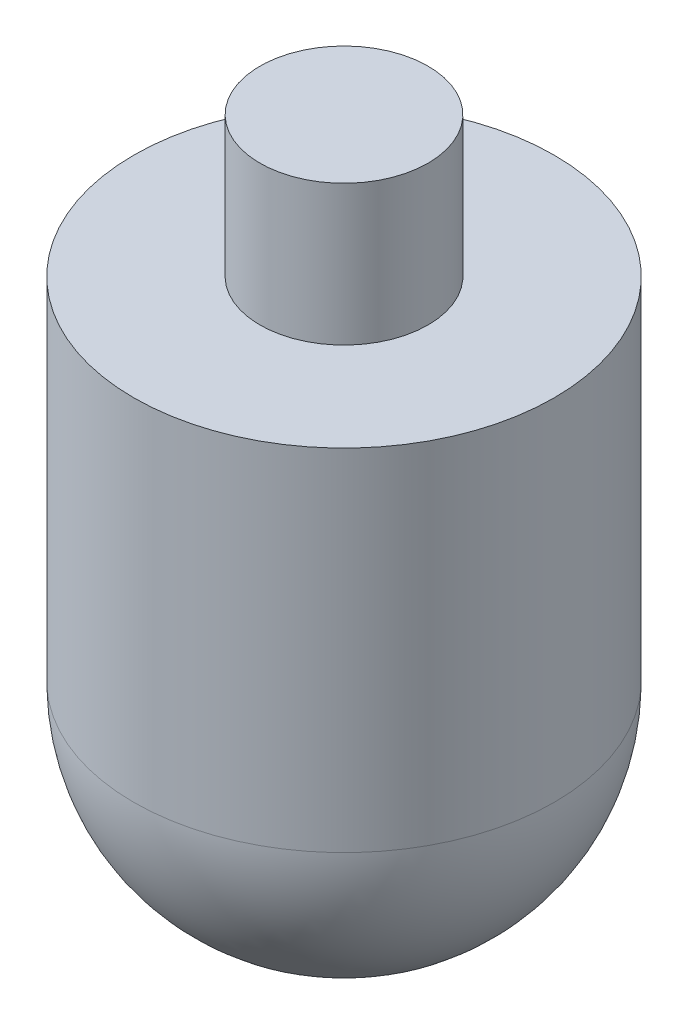
ISO-10303-21;
HEADER;
FILE_DESCRIPTION(('STEP AP214'),'2;1');
FILE_NAME('part.step','',(''),(''),'','','');
FILE_SCHEMA(('AUTOMOTIVE_DESIGN { 1 0 10303 214 1 1 1 1 }'));
ENDSEC;
DATA;
#1=APPLICATION_CONTEXT('core data for automotive mechanical design processes');
#2=APPLICATION_PROTOCOL_DEFINITION('international standard','automotive_design',2000,#1);
#3=PRODUCT_CONTEXT('',#1,'mechanical');
#4=PRODUCT('Part','Part','',(#3));
#5=PRODUCT_RELATED_PRODUCT_CATEGORY('part','',(#4));
#6=PRODUCT_DEFINITION_FORMATION('','',#4);
#7=PRODUCT_DEFINITION_CONTEXT('part definition',#1,'design');
#8=PRODUCT_DEFINITION('design','',#6,#7);
#9=PRODUCT_DEFINITION_SHAPE('','',#8);
#10=(LENGTH_UNIT() NAMED_UNIT(*) SI_UNIT(.MILLI.,.METRE.));
#11=(NAMED_UNIT(*) PLANE_ANGLE_UNIT() SI_UNIT($,.RADIAN.));
#12=(NAMED_UNIT(*) SI_UNIT($,.STERADIAN.) SOLID_ANGLE_UNIT());
#13=UNCERTAINTY_MEASURE_WITH_UNIT(LENGTH_MEASURE(1.E-05),#10,'distance_accuracy_value','');
#14=(GEOMETRIC_REPRESENTATION_CONTEXT(3) GLOBAL_UNCERTAINTY_ASSIGNED_CONTEXT((#13)) GLOBAL_UNIT_ASSIGNED_CONTEXT((#10,
#11,#12)) REPRESENTATION_CONTEXT('',''));
#15=CARTESIAN_POINT('',(0.,0.,0.));
#16=DIRECTION('',(0.,0.,1.));
#17=DIRECTION('',(1.,0.,0.));
#18=AXIS2_PLACEMENT_3D('',#15,#16,#17);
#19=CARTESIAN_POINT('',(0.,0.,0.));
#20=DIRECTION('',(0.,-1.,0.));
#21=DIRECTION('',(1.,0.,0.));
#22=AXIS2_PLACEMENT_3D('',#19,#20,#21);
#23=SPHERICAL_SURFACE('',#22,15.);
#24=CARTESIAN_POINT('',(0.,0.,0.));
#25=DIRECTION('',(0.,-1.,0.));
#26=DIRECTION('',(1.,0.,0.));
#27=AXIS2_PLACEMENT_3D('',#24,#25,#26);
#28=CIRCLE('',#27,15.);
#29=CARTESIAN_POINT('',(15.,0.,0.));
#30=VERTEX_POINT('',#29);
#31=EDGE_CURVE('E45',#30,#30,#28,.T.);
#32=ORIENTED_EDGE('',*,*,#31,.T.);
#33=EDGE_LOOP('',(#32));
#34=FACE_BOUND('',#33,.T.);
#35=ADVANCED_FACE('F31',(#34),#23,.T.);
#36=CARTESIAN_POINT('',(0.,35.,0.));
#37=DIRECTION('',(0.,1.,0.));
#38=DIRECTION('',(-1.,0.,0.));
#39=AXIS2_PLACEMENT_3D('',#36,#37,#38);
#40=PLANE('',#39);
#41=CARTESIAN_POINT('',(0.,35.,0.));
#42=DIRECTION('',(0.,-1.,0.));
#43=DIRECTION('',(1.,0.,0.));
#44=AXIS2_PLACEMENT_3D('',#41,#42,#43);
#45=CIRCLE('',#44,6.);
#46=CARTESIAN_POINT('',(6.,35.,0.));
#47=VERTEX_POINT('',#46);
#48=EDGE_CURVE('E10',#47,#47,#45,.T.);
#49=ORIENTED_EDGE('',*,*,#48,.F.);
#50=EDGE_LOOP('',(#49));
#51=FACE_BOUND('',#50,.T.);
#52=ADVANCED_FACE('F64',(#51),#40,.T.);
#53=CARTESIAN_POINT('',(0.,-15.,0.));
#54=DIRECTION('',(0.,-1.,0.));
#55=DIRECTION('',(1.,0.,0.));
#56=AXIS2_PLACEMENT_3D('',#53,#54,#55);
#57=CYLINDRICAL_SURFACE('',#56,6.);
#58=ORIENTED_EDGE('',*,*,#48,.T.);
#59=EDGE_LOOP('',(#58));
#60=FACE_BOUND('',#59,.T.);
#61=CARTESIAN_POINT('',(0.,25.,0.));
#62=DIRECTION('',(0.,-1.,0.));
#63=DIRECTION('',(1.,0.,0.));
#64=AXIS2_PLACEMENT_3D('',#61,#62,#63);
#65=CIRCLE('',#64,6.);
#66=CARTESIAN_POINT('',(6.,25.,0.));
#67=VERTEX_POINT('',#66);
#68=EDGE_CURVE('E37',#67,#67,#65,.T.);
#69=ORIENTED_EDGE('',*,*,#68,.F.);
#70=EDGE_LOOP('',(#69));
#71=FACE_BOUND('',#70,.T.);
#72=ADVANCED_FACE('F60',(#60,#71),#57,.T.);
#73=CARTESIAN_POINT('',(0.,25.,0.));
#74=DIRECTION('',(0.,-1.,0.));
#75=DIRECTION('',(1.,0.,0.));
#76=AXIS2_PLACEMENT_3D('',#73,#74,#75);
#77=PLANE('',#76);
#78=CARTESIAN_POINT('',(0.,25.,0.));
#79=DIRECTION('',(0.,-1.,0.));
#80=DIRECTION('',(1.,0.,0.));
#81=AXIS2_PLACEMENT_3D('',#78,#79,#80);
#82=CIRCLE('',#81,15.);
#83=CARTESIAN_POINT('',(15.,25.,0.));
#84=VERTEX_POINT('',#83);
#85=EDGE_CURVE('E41',#84,#84,#82,.T.);
#86=ORIENTED_EDGE('',*,*,#85,.F.);
#87=EDGE_LOOP('',(#86));
#88=FACE_BOUND('',#87,.T.);
#89=ORIENTED_EDGE('',*,*,#68,.T.);
#90=EDGE_LOOP('',(#89));
#91=FACE_BOUND('',#90,.T.);
#92=ADVANCED_FACE('F54',(#88,#91),#77,.F.);
#93=CARTESIAN_POINT('',(0.,-15.,0.));
#94=DIRECTION('',(0.,-1.,0.));
#95=DIRECTION('',(1.,0.,0.));
#96=AXIS2_PLACEMENT_3D('',#93,#94,#95);
#97=CYLINDRICAL_SURFACE('',#96,15.);
#98=ORIENTED_EDGE('',*,*,#85,.T.);
#99=EDGE_LOOP('',(#98));
#100=FACE_BOUND('',#99,.T.);
#101=ORIENTED_EDGE('',*,*,#31,.F.);
#102=EDGE_LOOP('',(#101));
#103=FACE_BOUND('',#102,.T.);
#104=ADVANCED_FACE('F52',(#100,#103),#97,.T.);
#105=CLOSED_SHELL('',(#35,#52,#72,#92,#104));
#106=MANIFOLD_SOLID_BREP('B2',#105);
#107=ADVANCED_BREP_SHAPE_REPRESENTATION('',(#18,#106),#14);
#108=SHAPE_DEFINITION_REPRESENTATION(#9,#107);
ENDSEC;
END-ISO-10303-21;
